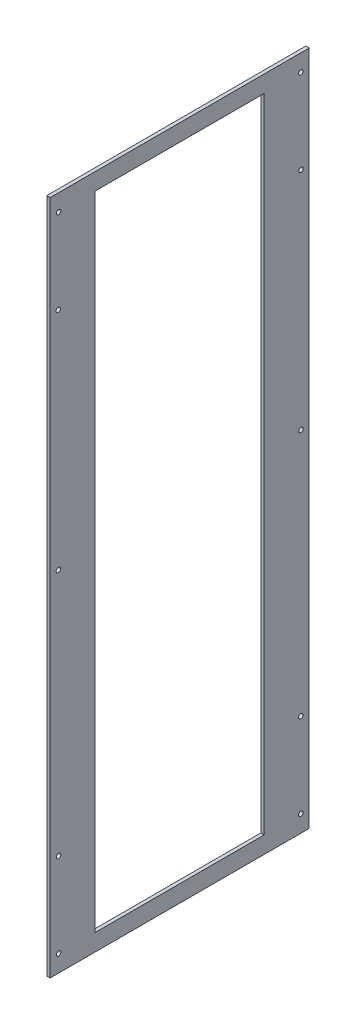
ISO-10303-21;
HEADER;
FILE_DESCRIPTION(('STEP AP214'),'2;1');
FILE_NAME('part.step','',(''),(''),'','','');
FILE_SCHEMA(('AUTOMOTIVE_DESIGN { 1 0 10303 214 1 1 1 1 }'));
ENDSEC;
DATA;
#1=APPLICATION_CONTEXT('core data for automotive mechanical design processes');
#2=APPLICATION_PROTOCOL_DEFINITION('international standard','automotive_design',2000,#1);
#3=PRODUCT_CONTEXT('',#1,'mechanical');
#4=PRODUCT('Part','Part','',(#3));
#5=PRODUCT_RELATED_PRODUCT_CATEGORY('part','',(#4));
#6=PRODUCT_DEFINITION_FORMATION('','',#4);
#7=PRODUCT_DEFINITION_CONTEXT('part definition',#1,'design');
#8=PRODUCT_DEFINITION('design','',#6,#7);
#9=PRODUCT_DEFINITION_SHAPE('','',#8);
#10=(LENGTH_UNIT() NAMED_UNIT(*) SI_UNIT(.MILLI.,.METRE.));
#11=(NAMED_UNIT(*) PLANE_ANGLE_UNIT() SI_UNIT($,.RADIAN.));
#12=(NAMED_UNIT(*) SI_UNIT($,.STERADIAN.) SOLID_ANGLE_UNIT());
#13=UNCERTAINTY_MEASURE_WITH_UNIT(LENGTH_MEASURE(1.E-05),#10,'distance_accuracy_value','');
#14=(GEOMETRIC_REPRESENTATION_CONTEXT(3) GLOBAL_UNCERTAINTY_ASSIGNED_CONTEXT((#13)) GLOBAL_UNIT_ASSIGNED_CONTEXT((#10,
#11,#12)) REPRESENTATION_CONTEXT('',''));
#15=CARTESIAN_POINT('',(0.,0.,0.));
#16=DIRECTION('',(0.,0.,1.));
#17=DIRECTION('',(1.,0.,0.));
#18=AXIS2_PLACEMENT_3D('',#15,#16,#17);
#19=CARTESIAN_POINT('',(3.,0.,0.));
#20=DIRECTION('',(-1.,0.,0.));
#21=DIRECTION('',(0.,0.,1.));
#22=AXIS2_PLACEMENT_3D('',#19,#20,#21);
#23=PLANE('',#22);
#24=DIRECTION('',(0.,1.,0.));
#25=VECTOR('',#24,1.);
#26=CARTESIAN_POINT('',(3.,-300.,-115.));
#27=LINE('',#26,#25);
#28=CARTESIAN_POINT('',(3.,-300.,-115.));
#29=VERTEX_POINT('',#28);
#30=CARTESIAN_POINT('',(3.,300.,-115.));
#31=VERTEX_POINT('',#30);
#32=EDGE_CURVE('E141',#29,#31,#27,.T.);
#33=ORIENTED_EDGE('',*,*,#32,.T.);
#34=DIRECTION('',(0.,0.,1.));
#35=VECTOR('',#34,1.);
#36=CARTESIAN_POINT('',(3.,300.,115.));
#37=LINE('',#36,#35);
#38=CARTESIAN_POINT('',(3.,300.,115.));
#39=VERTEX_POINT('',#38);
#40=EDGE_CURVE('E144',#31,#39,#37,.T.);
#41=ORIENTED_EDGE('',*,*,#40,.T.);
#42=DIRECTION('',(0.,-1.,0.));
#43=VECTOR('',#42,1.);
#44=CARTESIAN_POINT('',(3.,-300.,115.));
#45=LINE('',#44,#43);
#46=CARTESIAN_POINT('',(3.,-300.,115.));
#47=VERTEX_POINT('',#46);
#48=EDGE_CURVE('E147',#39,#47,#45,.T.);
#49=ORIENTED_EDGE('',*,*,#48,.T.);
#50=DIRECTION('',(0.,0.,-1.));
#51=VECTOR('',#50,1.);
#52=CARTESIAN_POINT('',(3.,-300.,115.));
#53=LINE('',#52,#51);
#54=EDGE_CURVE('E149',#47,#29,#53,.T.);
#55=ORIENTED_EDGE('',*,*,#54,.T.);
#56=EDGE_LOOP('',(#33,#41,#49,#55));
#57=FACE_BOUND('',#56,.T.);
#58=DIRECTION('',(0.,1.,0.));
#59=VECTOR('',#58,1.);
#60=CARTESIAN_POINT('',(3.,-285.,-75.));
#61=LINE('',#60,#59);
#62=CARTESIAN_POINT('',(3.,-285.,-75.));
#63=VERTEX_POINT('',#62);
#64=CARTESIAN_POINT('',(3.,285.,-75.));
#65=VERTEX_POINT('',#64);
#66=EDGE_CURVE('E102',#63,#65,#61,.T.);
#67=ORIENTED_EDGE('',*,*,#66,.F.);
#68=DIRECTION('',(0.,0.,-1.));
#69=VECTOR('',#68,1.);
#70=CARTESIAN_POINT('',(3.,-285.,75.));
#71=LINE('',#70,#69);
#72=CARTESIAN_POINT('',(3.,-285.,75.));
#73=VERTEX_POINT('',#72);
#74=EDGE_CURVE('E125',#73,#63,#71,.T.);
#75=ORIENTED_EDGE('',*,*,#74,.F.);
#76=DIRECTION('',(0.,-1.,0.));
#77=VECTOR('',#76,1.);
#78=CARTESIAN_POINT('',(3.,-285.,75.));
#79=LINE('',#78,#77);
#80=CARTESIAN_POINT('',(3.,285.,75.));
#81=VERTEX_POINT('',#80);
#82=EDGE_CURVE('E123',#81,#73,#79,.T.);
#83=ORIENTED_EDGE('',*,*,#82,.F.);
#84=DIRECTION('',(0.,0.,1.));
#85=VECTOR('',#84,1.);
#86=CARTESIAN_POINT('',(3.,285.,75.));
#87=LINE('',#86,#85);
#88=EDGE_CURVE('E110',#65,#81,#87,.T.);
#89=ORIENTED_EDGE('',*,*,#88,.F.);
#90=EDGE_LOOP('',(#67,#75,#83,#89));
#91=FACE_BOUND('',#90,.T.);
#92=CARTESIAN_POINT('',(3.,285.,107.5));
#93=DIRECTION('',(1.,0.,0.));
#94=DIRECTION('',(0.,0.,-1.));
#95=AXIS2_PLACEMENT_3D('',#92,#93,#94);
#96=CIRCLE('',#95,2.);
#97=CARTESIAN_POINT('',(3.,285.,105.5));
#98=VERTEX_POINT('',#97);
#99=EDGE_CURVE('E131',#98,#98,#96,.T.);
#100=ORIENTED_EDGE('',*,*,#99,.F.);
#101=EDGE_LOOP('',(#100));
#102=FACE_BOUND('',#101,.T.);
#103=CARTESIAN_POINT('',(3.,210.,107.698004771645));
#104=DIRECTION('',(1.,0.,0.));
#105=DIRECTION('',(0.,0.,-1.));
#106=AXIS2_PLACEMENT_3D('',#103,#104,#105);
#107=CIRCLE('',#106,2.);
#108=CARTESIAN_POINT('',(3.,210.,105.698004771645));
#109=VERTEX_POINT('',#108);
#110=EDGE_CURVE('E313',#109,#109,#107,.T.);
#111=ORIENTED_EDGE('',*,*,#110,.F.);
#112=EDGE_LOOP('',(#111));
#113=FACE_BOUND('',#112,.T.);
#114=CARTESIAN_POINT('',(3.,-210.,107.5));
#115=DIRECTION('',(1.,0.,0.));
#116=DIRECTION('',(0.,0.,-1.));
#117=AXIS2_PLACEMENT_3D('',#114,#115,#116);
#118=CIRCLE('',#117,2.);
#119=CARTESIAN_POINT('',(3.,-210.,105.5));
#120=VERTEX_POINT('',#119);
#121=EDGE_CURVE('E307',#120,#120,#118,.T.);
#122=ORIENTED_EDGE('',*,*,#121,.F.);
#123=EDGE_LOOP('',(#122));
#124=FACE_BOUND('',#123,.T.);
#125=CARTESIAN_POINT('',(3.,-285.,107.5));
#126=DIRECTION('',(1.,0.,0.));
#127=DIRECTION('',(0.,0.,-1.));
#128=AXIS2_PLACEMENT_3D('',#125,#126,#127);
#129=CIRCLE('',#128,2.);
#130=CARTESIAN_POINT('',(3.,-285.,105.5));
#131=VERTEX_POINT('',#130);
#132=EDGE_CURVE('E301',#131,#131,#129,.T.);
#133=ORIENTED_EDGE('',*,*,#132,.F.);
#134=EDGE_LOOP('',(#133));
#135=FACE_BOUND('',#134,.T.);
#136=CARTESIAN_POINT('',(3.,10.,107.698004771645));
#137=DIRECTION('',(1.,0.,0.));
#138=DIRECTION('',(0.,0.,-1.));
#139=AXIS2_PLACEMENT_3D('',#136,#137,#138);
#140=CIRCLE('',#139,2.);
#141=CARTESIAN_POINT('',(3.,10.,105.698004771645));
#142=VERTEX_POINT('',#141);
#143=EDGE_CURVE('E295',#142,#142,#140,.T.);
#144=ORIENTED_EDGE('',*,*,#143,.F.);
#145=EDGE_LOOP('',(#144));
#146=FACE_BOUND('',#145,.T.);
#147=CARTESIAN_POINT('',(3.,-285.,-107.5));
#148=DIRECTION('',(1.,0.,0.));
#149=DIRECTION('',(0.,0.,1.));
#150=AXIS2_PLACEMENT_3D('',#147,#148,#149);
#151=CIRCLE('',#150,2.);
#152=CARTESIAN_POINT('',(3.,-285.,-105.5));
#153=VERTEX_POINT('',#152);
#154=EDGE_CURVE('E289',#153,#153,#151,.T.);
#155=ORIENTED_EDGE('',*,*,#154,.F.);
#156=EDGE_LOOP('',(#155));
#157=FACE_BOUND('',#156,.T.);
#158=CARTESIAN_POINT('',(3.,-210.,-107.5));
#159=DIRECTION('',(1.,0.,0.));
#160=DIRECTION('',(0.,0.,1.));
#161=AXIS2_PLACEMENT_3D('',#158,#159,#160);
#162=CIRCLE('',#161,2.);
#163=CARTESIAN_POINT('',(3.,-210.,-105.5));
#164=VERTEX_POINT('',#163);
#165=EDGE_CURVE('E283',#164,#164,#162,.T.);
#166=ORIENTED_EDGE('',*,*,#165,.F.);
#167=EDGE_LOOP('',(#166));
#168=FACE_BOUND('',#167,.T.);
#169=CARTESIAN_POINT('',(3.,210.,-107.698004771645));
#170=DIRECTION('',(1.,0.,0.));
#171=DIRECTION('',(0.,0.,1.));
#172=AXIS2_PLACEMENT_3D('',#169,#170,#171);
#173=CIRCLE('',#172,2.);
#174=CARTESIAN_POINT('',(3.,210.,-105.698004771645));
#175=VERTEX_POINT('',#174);
#176=EDGE_CURVE('E277',#175,#175,#173,.T.);
#177=ORIENTED_EDGE('',*,*,#176,.F.);
#178=EDGE_LOOP('',(#177));
#179=FACE_BOUND('',#178,.T.);
#180=CARTESIAN_POINT('',(3.,285.,-107.5));
#181=DIRECTION('',(1.,0.,0.));
#182=DIRECTION('',(0.,0.,1.));
#183=AXIS2_PLACEMENT_3D('',#180,#181,#182);
#184=CIRCLE('',#183,2.);
#185=CARTESIAN_POINT('',(3.,285.,-105.5));
#186=VERTEX_POINT('',#185);
#187=EDGE_CURVE('E271',#186,#186,#184,.T.);
#188=ORIENTED_EDGE('',*,*,#187,.F.);
#189=EDGE_LOOP('',(#188));
#190=FACE_BOUND('',#189,.T.);
#191=CARTESIAN_POINT('',(3.,10.,-107.698004771645));
#192=DIRECTION('',(1.,0.,0.));
#193=DIRECTION('',(0.,0.,1.));
#194=AXIS2_PLACEMENT_3D('',#191,#192,#193);
#195=CIRCLE('',#194,2.);
#196=CARTESIAN_POINT('',(3.,10.,-105.698004771645));
#197=VERTEX_POINT('',#196);
#198=EDGE_CURVE('E262',#197,#197,#195,.T.);
#199=ORIENTED_EDGE('',*,*,#198,.F.);
#200=EDGE_LOOP('',(#199));
#201=FACE_BOUND('',#200,.T.);
#202=ADVANCED_FACE('F37',(#57,#91,#102,#113,#124,#135,#146,#157,#168,#179,#190,#201),#23,.F.);
#203=CARTESIAN_POINT('',(0.,0.,0.));
#204=DIRECTION('',(-1.,0.,0.));
#205=DIRECTION('',(0.,0.,1.));
#206=AXIS2_PLACEMENT_3D('',#203,#204,#205);
#207=PLANE('',#206);
#208=CARTESIAN_POINT('',(0.,285.,-107.5));
#209=DIRECTION('',(1.,0.,0.));
#210=DIRECTION('',(0.,0.,1.));
#211=AXIS2_PLACEMENT_3D('',#208,#209,#210);
#212=CIRCLE('',#211,2.);
#213=CARTESIAN_POINT('',(0.,285.,-105.5));
#214=VERTEX_POINT('',#213);
#215=EDGE_CURVE('E268',#214,#214,#212,.T.);
#216=ORIENTED_EDGE('',*,*,#215,.T.);
#217=EDGE_LOOP('',(#216));
#218=FACE_BOUND('',#217,.T.);
#219=CARTESIAN_POINT('',(0.,-210.,-107.5));
#220=DIRECTION('',(1.,0.,0.));
#221=DIRECTION('',(0.,0.,1.));
#222=AXIS2_PLACEMENT_3D('',#219,#220,#221);
#223=CIRCLE('',#222,2.);
#224=CARTESIAN_POINT('',(0.,-210.,-105.5));
#225=VERTEX_POINT('',#224);
#226=EDGE_CURVE('E280',#225,#225,#223,.T.);
#227=ORIENTED_EDGE('',*,*,#226,.T.);
#228=EDGE_LOOP('',(#227));
#229=FACE_BOUND('',#228,.T.);
#230=CARTESIAN_POINT('',(0.,10.,107.698004771645));
#231=DIRECTION('',(1.,0.,0.));
#232=DIRECTION('',(0.,0.,-1.));
#233=AXIS2_PLACEMENT_3D('',#230,#231,#232);
#234=CIRCLE('',#233,2.);
#235=CARTESIAN_POINT('',(0.,10.,105.698004771645));
#236=VERTEX_POINT('',#235);
#237=EDGE_CURVE('E292',#236,#236,#234,.T.);
#238=ORIENTED_EDGE('',*,*,#237,.T.);
#239=EDGE_LOOP('',(#238));
#240=FACE_BOUND('',#239,.T.);
#241=CARTESIAN_POINT('',(0.,-210.,107.5));
#242=DIRECTION('',(1.,0.,0.));
#243=DIRECTION('',(0.,0.,-1.));
#244=AXIS2_PLACEMENT_3D('',#241,#242,#243);
#245=CIRCLE('',#244,2.);
#246=CARTESIAN_POINT('',(0.,-210.,105.5));
#247=VERTEX_POINT('',#246);
#248=EDGE_CURVE('E304',#247,#247,#245,.T.);
#249=ORIENTED_EDGE('',*,*,#248,.T.);
#250=EDGE_LOOP('',(#249));
#251=FACE_BOUND('',#250,.T.);
#252=CARTESIAN_POINT('',(0.,285.,107.5));
#253=DIRECTION('',(1.,0.,0.));
#254=DIRECTION('',(0.,0.,-1.));
#255=AXIS2_PLACEMENT_3D('',#252,#253,#254);
#256=CIRCLE('',#255,2.);
#257=CARTESIAN_POINT('',(0.,285.,105.5));
#258=VERTEX_POINT('',#257);
#259=EDGE_CURVE('E316',#258,#258,#256,.T.);
#260=ORIENTED_EDGE('',*,*,#259,.T.);
#261=EDGE_LOOP('',(#260));
#262=FACE_BOUND('',#261,.T.);
#263=DIRECTION('',(0.,1.,0.));
#264=VECTOR('',#263,1.);
#265=CARTESIAN_POINT('',(0.,-300.,-115.));
#266=LINE('',#265,#264);
#267=CARTESIAN_POINT('',(0.,-300.,-115.));
#268=VERTEX_POINT('',#267);
#269=CARTESIAN_POINT('',(0.,300.,-115.));
#270=VERTEX_POINT('',#269);
#271=EDGE_CURVE('E118',#268,#270,#266,.T.);
#272=ORIENTED_EDGE('',*,*,#271,.F.);
#273=DIRECTION('',(0.,0.,-1.));
#274=VECTOR('',#273,1.);
#275=CARTESIAN_POINT('',(0.,-300.,115.));
#276=LINE('',#275,#274);
#277=CARTESIAN_POINT('',(0.,-300.,115.));
#278=VERTEX_POINT('',#277);
#279=EDGE_CURVE('E145',#278,#268,#276,.T.);
#280=ORIENTED_EDGE('',*,*,#279,.F.);
#281=DIRECTION('',(0.,-1.,0.));
#282=VECTOR('',#281,1.);
#283=CARTESIAN_POINT('',(0.,-300.,115.));
#284=LINE('',#283,#282);
#285=CARTESIAN_POINT('',(0.,300.,115.));
#286=VERTEX_POINT('',#285);
#287=EDGE_CURVE('E156',#286,#278,#284,.T.);
#288=ORIENTED_EDGE('',*,*,#287,.F.);
#289=DIRECTION('',(0.,0.,1.));
#290=VECTOR('',#289,1.);
#291=CARTESIAN_POINT('',(0.,300.,115.));
#292=LINE('',#291,#290);
#293=EDGE_CURVE('E154',#270,#286,#292,.T.);
#294=ORIENTED_EDGE('',*,*,#293,.F.);
#295=EDGE_LOOP('',(#272,#280,#288,#294));
#296=FACE_BOUND('',#295,.T.);
#297=DIRECTION('',(0.,0.,-1.));
#298=VECTOR('',#297,1.);
#299=CARTESIAN_POINT('',(0.,-285.,75.));
#300=LINE('',#299,#298);
#301=CARTESIAN_POINT('',(0.,-285.,75.));
#302=VERTEX_POINT('',#301);
#303=CARTESIAN_POINT('',(0.,-285.,-75.));
#304=VERTEX_POINT('',#303);
#305=EDGE_CURVE('E111',#302,#304,#300,.T.);
#306=ORIENTED_EDGE('',*,*,#305,.T.);
#307=DIRECTION('',(0.,1.,0.));
#308=VECTOR('',#307,1.);
#309=CARTESIAN_POINT('',(0.,-285.,-75.));
#310=LINE('',#309,#308);
#311=CARTESIAN_POINT('',(0.,285.,-75.));
#312=VERTEX_POINT('',#311);
#313=EDGE_CURVE('E60',#304,#312,#310,.T.);
#314=ORIENTED_EDGE('',*,*,#313,.T.);
#315=DIRECTION('',(0.,0.,1.));
#316=VECTOR('',#315,1.);
#317=CARTESIAN_POINT('',(0.,285.,75.));
#318=LINE('',#317,#316);
#319=CARTESIAN_POINT('',(0.,285.,75.));
#320=VERTEX_POINT('',#319);
#321=EDGE_CURVE('E117',#312,#320,#318,.T.);
#322=ORIENTED_EDGE('',*,*,#321,.T.);
#323=DIRECTION('',(0.,-1.,0.));
#324=VECTOR('',#323,1.);
#325=CARTESIAN_POINT('',(0.,-285.,75.));
#326=LINE('',#325,#324);
#327=EDGE_CURVE('E133',#320,#302,#326,.T.);
#328=ORIENTED_EDGE('',*,*,#327,.T.);
#329=EDGE_LOOP('',(#306,#314,#322,#328));
#330=FACE_BOUND('',#329,.T.);
#331=CARTESIAN_POINT('',(0.,210.,107.698004771645));
#332=DIRECTION('',(1.,0.,0.));
#333=DIRECTION('',(0.,0.,-1.));
#334=AXIS2_PLACEMENT_3D('',#331,#332,#333);
#335=CIRCLE('',#334,2.);
#336=CARTESIAN_POINT('',(0.,210.,105.698004771645));
#337=VERTEX_POINT('',#336);
#338=EDGE_CURVE('E310',#337,#337,#335,.T.);
#339=ORIENTED_EDGE('',*,*,#338,.T.);
#340=EDGE_LOOP('',(#339));
#341=FACE_BOUND('',#340,.T.);
#342=CARTESIAN_POINT('',(0.,-285.,107.5));
#343=DIRECTION('',(1.,0.,0.));
#344=DIRECTION('',(0.,0.,-1.));
#345=AXIS2_PLACEMENT_3D('',#342,#343,#344);
#346=CIRCLE('',#345,2.);
#347=CARTESIAN_POINT('',(0.,-285.,105.5));
#348=VERTEX_POINT('',#347);
#349=EDGE_CURVE('E298',#348,#348,#346,.T.);
#350=ORIENTED_EDGE('',*,*,#349,.T.);
#351=EDGE_LOOP('',(#350));
#352=FACE_BOUND('',#351,.T.);
#353=CARTESIAN_POINT('',(0.,-285.,-107.5));
#354=DIRECTION('',(1.,0.,0.));
#355=DIRECTION('',(0.,0.,1.));
#356=AXIS2_PLACEMENT_3D('',#353,#354,#355);
#357=CIRCLE('',#356,2.);
#358=CARTESIAN_POINT('',(0.,-285.,-105.5));
#359=VERTEX_POINT('',#358);
#360=EDGE_CURVE('E286',#359,#359,#357,.T.);
#361=ORIENTED_EDGE('',*,*,#360,.T.);
#362=EDGE_LOOP('',(#361));
#363=FACE_BOUND('',#362,.T.);
#364=CARTESIAN_POINT('',(0.,210.,-107.698004771645));
#365=DIRECTION('',(1.,0.,0.));
#366=DIRECTION('',(0.,0.,1.));
#367=AXIS2_PLACEMENT_3D('',#364,#365,#366);
#368=CIRCLE('',#367,2.);
#369=CARTESIAN_POINT('',(0.,210.,-105.698004771645));
#370=VERTEX_POINT('',#369);
#371=EDGE_CURVE('E274',#370,#370,#368,.T.);
#372=ORIENTED_EDGE('',*,*,#371,.T.);
#373=EDGE_LOOP('',(#372));
#374=FACE_BOUND('',#373,.T.);
#375=CARTESIAN_POINT('',(0.,10.,-107.698004771645));
#376=DIRECTION('',(1.,0.,0.));
#377=DIRECTION('',(0.,0.,1.));
#378=AXIS2_PLACEMENT_3D('',#375,#376,#377);
#379=CIRCLE('',#378,2.);
#380=CARTESIAN_POINT('',(0.,10.,-105.698004771645));
#381=VERTEX_POINT('',#380);
#382=EDGE_CURVE('E265',#381,#381,#379,.T.);
#383=ORIENTED_EDGE('',*,*,#382,.T.);
#384=EDGE_LOOP('',(#383));
#385=FACE_BOUND('',#384,.T.);
#386=ADVANCED_FACE('F174',(#218,#229,#240,#251,#262,#296,#330,#341,#352,#363,#374,#385),#207,.T.);
#387=CARTESIAN_POINT('',(3.,-300.,-115.));
#388=DIRECTION('',(0.,0.,1.));
#389=DIRECTION('',(1.,0.,0.));
#390=AXIS2_PLACEMENT_3D('',#387,#388,#389);
#391=PLANE('',#390);
#392=ORIENTED_EDGE('',*,*,#271,.T.);
#393=DIRECTION('',(-1.,0.,0.));
#394=VECTOR('',#393,1.);
#395=CARTESIAN_POINT('',(3.,300.,-115.));
#396=LINE('',#395,#394);
#397=EDGE_CURVE('E11',#31,#270,#396,.T.);
#398=ORIENTED_EDGE('',*,*,#397,.F.);
#399=ORIENTED_EDGE('',*,*,#32,.F.);
#400=DIRECTION('',(-1.,0.,0.));
#401=VECTOR('',#400,1.);
#402=CARTESIAN_POINT('',(3.,-300.,-115.));
#403=LINE('',#402,#401);
#404=EDGE_CURVE('E151',#29,#268,#403,.T.);
#405=ORIENTED_EDGE('',*,*,#404,.T.);
#406=EDGE_LOOP('',(#392,#398,#399,#405));
#407=FACE_BOUND('',#406,.T.);
#408=ADVANCED_FACE('F39',(#407),#391,.F.);
#409=CARTESIAN_POINT('',(3.,300.,115.));
#410=DIRECTION('',(0.,-1.,0.));
#411=DIRECTION('',(0.,0.,-1.));
#412=AXIS2_PLACEMENT_3D('',#409,#410,#411);
#413=PLANE('',#412);
#414=ORIENTED_EDGE('',*,*,#293,.T.);
#415=DIRECTION('',(-1.,0.,0.));
#416=VECTOR('',#415,1.);
#417=CARTESIAN_POINT('',(3.,300.,115.));
#418=LINE('',#417,#416);
#419=EDGE_CURVE('E45',#39,#286,#418,.T.);
#420=ORIENTED_EDGE('',*,*,#419,.F.);
#421=ORIENTED_EDGE('',*,*,#40,.F.);
#422=ORIENTED_EDGE('',*,*,#397,.T.);
#423=EDGE_LOOP('',(#414,#420,#421,#422));
#424=FACE_BOUND('',#423,.T.);
#425=ADVANCED_FACE('F184',(#424),#413,.F.);
#426=CARTESIAN_POINT('',(3.,-300.,115.));
#427=DIRECTION('',(0.,0.,-1.));
#428=DIRECTION('',(-1.,0.,0.));
#429=AXIS2_PLACEMENT_3D('',#426,#427,#428);
#430=PLANE('',#429);
#431=ORIENTED_EDGE('',*,*,#287,.T.);
#432=DIRECTION('',(-1.,0.,0.));
#433=VECTOR('',#432,1.);
#434=CARTESIAN_POINT('',(3.,-300.,115.));
#435=LINE('',#434,#433);
#436=EDGE_CURVE('E161',#47,#278,#435,.T.);
#437=ORIENTED_EDGE('',*,*,#436,.F.);
#438=ORIENTED_EDGE('',*,*,#48,.F.);
#439=ORIENTED_EDGE('',*,*,#419,.T.);
#440=EDGE_LOOP('',(#431,#437,#438,#439));
#441=FACE_BOUND('',#440,.T.);
#442=ADVANCED_FACE('F168',(#441),#430,.F.);
#443=CARTESIAN_POINT('',(3.,-300.,115.));
#444=DIRECTION('',(0.,1.,0.));
#445=DIRECTION('',(0.,0.,1.));
#446=AXIS2_PLACEMENT_3D('',#443,#444,#445);
#447=PLANE('',#446);
#448=ORIENTED_EDGE('',*,*,#279,.T.);
#449=ORIENTED_EDGE('',*,*,#404,.F.);
#450=ORIENTED_EDGE('',*,*,#54,.F.);
#451=ORIENTED_EDGE('',*,*,#436,.T.);
#452=EDGE_LOOP('',(#448,#449,#450,#451));
#453=FACE_BOUND('',#452,.T.);
#454=ADVANCED_FACE('F178',(#453),#447,.F.);
#455=CARTESIAN_POINT('',(3.,-285.,-75.));
#456=DIRECTION('',(0.,0.,1.));
#457=DIRECTION('',(1.,0.,0.));
#458=AXIS2_PLACEMENT_3D('',#455,#456,#457);
#459=PLANE('',#458);
#460=ORIENTED_EDGE('',*,*,#313,.F.);
#461=DIRECTION('',(-1.,0.,0.));
#462=VECTOR('',#461,1.);
#463=CARTESIAN_POINT('',(3.,-285.,-75.));
#464=LINE('',#463,#462);
#465=EDGE_CURVE('E106',#63,#304,#464,.T.);
#466=ORIENTED_EDGE('',*,*,#465,.F.);
#467=ORIENTED_EDGE('',*,*,#66,.T.);
#468=DIRECTION('',(-1.,0.,0.));
#469=VECTOR('',#468,1.);
#470=CARTESIAN_POINT('',(3.,285.,-75.));
#471=LINE('',#470,#469);
#472=EDGE_CURVE('E105',#65,#312,#471,.T.);
#473=ORIENTED_EDGE('',*,*,#472,.T.);
#474=EDGE_LOOP('',(#460,#466,#467,#473));
#475=FACE_BOUND('',#474,.T.);
#476=ADVANCED_FACE('F104',(#475),#459,.T.);
#477=CARTESIAN_POINT('',(3.,285.,75.));
#478=DIRECTION('',(0.,-1.,0.));
#479=DIRECTION('',(0.,0.,-1.));
#480=AXIS2_PLACEMENT_3D('',#477,#478,#479);
#481=PLANE('',#480);
#482=ORIENTED_EDGE('',*,*,#321,.F.);
#483=ORIENTED_EDGE('',*,*,#472,.F.);
#484=ORIENTED_EDGE('',*,*,#88,.T.);
#485=DIRECTION('',(-1.,0.,0.));
#486=VECTOR('',#485,1.);
#487=CARTESIAN_POINT('',(3.,285.,75.));
#488=LINE('',#487,#486);
#489=EDGE_CURVE('E119',#81,#320,#488,.T.);
#490=ORIENTED_EDGE('',*,*,#489,.T.);
#491=EDGE_LOOP('',(#482,#483,#484,#490));
#492=FACE_BOUND('',#491,.T.);
#493=ADVANCED_FACE('F114',(#492),#481,.T.);
#494=CARTESIAN_POINT('',(3.,-285.,75.));
#495=DIRECTION('',(0.,0.,-1.));
#496=DIRECTION('',(-1.,0.,0.));
#497=AXIS2_PLACEMENT_3D('',#494,#495,#496);
#498=PLANE('',#497);
#499=ORIENTED_EDGE('',*,*,#327,.F.);
#500=ORIENTED_EDGE('',*,*,#489,.F.);
#501=ORIENTED_EDGE('',*,*,#82,.T.);
#502=DIRECTION('',(-1.,0.,0.));
#503=VECTOR('',#502,1.);
#504=CARTESIAN_POINT('',(3.,-285.,75.));
#505=LINE('',#504,#503);
#506=EDGE_CURVE('E52',#73,#302,#505,.T.);
#507=ORIENTED_EDGE('',*,*,#506,.T.);
#508=EDGE_LOOP('',(#499,#500,#501,#507));
#509=FACE_BOUND('',#508,.T.);
#510=ADVANCED_FACE('F208',(#509),#498,.T.);
#511=CARTESIAN_POINT('',(3.,-285.,75.));
#512=DIRECTION('',(0.,1.,0.));
#513=DIRECTION('',(0.,0.,1.));
#514=AXIS2_PLACEMENT_3D('',#511,#512,#513);
#515=PLANE('',#514);
#516=ORIENTED_EDGE('',*,*,#305,.F.);
#517=ORIENTED_EDGE('',*,*,#506,.F.);
#518=ORIENTED_EDGE('',*,*,#74,.T.);
#519=ORIENTED_EDGE('',*,*,#465,.T.);
#520=EDGE_LOOP('',(#516,#517,#518,#519));
#521=FACE_BOUND('',#520,.T.);
#522=ADVANCED_FACE('F212',(#521),#515,.T.);
#523=CARTESIAN_POINT('',(3.,285.,107.5));
#524=DIRECTION('',(-1.,0.,0.));
#525=DIRECTION('',(0.,0.,1.));
#526=AXIS2_PLACEMENT_3D('',#523,#524,#525);
#527=CYLINDRICAL_SURFACE('',#526,2.);
#528=ORIENTED_EDGE('',*,*,#99,.T.);
#529=EDGE_LOOP('',(#528));
#530=FACE_BOUND('',#529,.T.);
#531=ORIENTED_EDGE('',*,*,#259,.F.);
#532=EDGE_LOOP('',(#531));
#533=FACE_BOUND('',#532,.T.);
#534=ADVANCED_FACE('F218',(#530,#533),#527,.F.);
#535=CARTESIAN_POINT('',(3.,210.,107.698004771645));
#536=DIRECTION('',(-1.,0.,0.));
#537=DIRECTION('',(0.,0.,1.));
#538=AXIS2_PLACEMENT_3D('',#535,#536,#537);
#539=CYLINDRICAL_SURFACE('',#538,2.);
#540=ORIENTED_EDGE('',*,*,#110,.T.);
#541=EDGE_LOOP('',(#540));
#542=FACE_BOUND('',#541,.T.);
#543=ORIENTED_EDGE('',*,*,#338,.F.);
#544=EDGE_LOOP('',(#543));
#545=FACE_BOUND('',#544,.T.);
#546=ADVANCED_FACE('F221',(#542,#545),#539,.F.);
#547=CARTESIAN_POINT('',(3.,-210.,107.5));
#548=DIRECTION('',(-1.,0.,0.));
#549=DIRECTION('',(0.,0.,1.));
#550=AXIS2_PLACEMENT_3D('',#547,#548,#549);
#551=CYLINDRICAL_SURFACE('',#550,2.);
#552=ORIENTED_EDGE('',*,*,#121,.T.);
#553=EDGE_LOOP('',(#552));
#554=FACE_BOUND('',#553,.T.);
#555=ORIENTED_EDGE('',*,*,#248,.F.);
#556=EDGE_LOOP('',(#555));
#557=FACE_BOUND('',#556,.T.);
#558=ADVANCED_FACE('F225',(#554,#557),#551,.F.);
#559=CARTESIAN_POINT('',(3.,-285.,107.5));
#560=DIRECTION('',(-1.,0.,0.));
#561=DIRECTION('',(0.,0.,1.));
#562=AXIS2_PLACEMENT_3D('',#559,#560,#561);
#563=CYLINDRICAL_SURFACE('',#562,2.);
#564=ORIENTED_EDGE('',*,*,#132,.T.);
#565=EDGE_LOOP('',(#564));
#566=FACE_BOUND('',#565,.T.);
#567=ORIENTED_EDGE('',*,*,#349,.F.);
#568=EDGE_LOOP('',(#567));
#569=FACE_BOUND('',#568,.T.);
#570=ADVANCED_FACE('F229',(#566,#569),#563,.F.);
#571=CARTESIAN_POINT('',(3.,10.,107.698004771645));
#572=DIRECTION('',(-1.,0.,0.));
#573=DIRECTION('',(0.,0.,1.));
#574=AXIS2_PLACEMENT_3D('',#571,#572,#573);
#575=CYLINDRICAL_SURFACE('',#574,2.);
#576=ORIENTED_EDGE('',*,*,#143,.T.);
#577=EDGE_LOOP('',(#576));
#578=FACE_BOUND('',#577,.T.);
#579=ORIENTED_EDGE('',*,*,#237,.F.);
#580=EDGE_LOOP('',(#579));
#581=FACE_BOUND('',#580,.T.);
#582=ADVANCED_FACE('F233',(#578,#581),#575,.F.);
#583=CARTESIAN_POINT('',(3.,-285.,-107.5));
#584=DIRECTION('',(-1.,0.,0.));
#585=DIRECTION('',(0.,0.,1.));
#586=AXIS2_PLACEMENT_3D('',#583,#584,#585);
#587=CYLINDRICAL_SURFACE('',#586,2.);
#588=ORIENTED_EDGE('',*,*,#154,.T.);
#589=EDGE_LOOP('',(#588));
#590=FACE_BOUND('',#589,.T.);
#591=ORIENTED_EDGE('',*,*,#360,.F.);
#592=EDGE_LOOP('',(#591));
#593=FACE_BOUND('',#592,.T.);
#594=ADVANCED_FACE('F237',(#590,#593),#587,.F.);
#595=CARTESIAN_POINT('',(3.,-210.,-107.5));
#596=DIRECTION('',(-1.,0.,0.));
#597=DIRECTION('',(0.,0.,1.));
#598=AXIS2_PLACEMENT_3D('',#595,#596,#597);
#599=CYLINDRICAL_SURFACE('',#598,2.);
#600=ORIENTED_EDGE('',*,*,#165,.T.);
#601=EDGE_LOOP('',(#600));
#602=FACE_BOUND('',#601,.T.);
#603=ORIENTED_EDGE('',*,*,#226,.F.);
#604=EDGE_LOOP('',(#603));
#605=FACE_BOUND('',#604,.T.);
#606=ADVANCED_FACE('F241',(#602,#605),#599,.F.);
#607=CARTESIAN_POINT('',(3.,210.,-107.698004771645));
#608=DIRECTION('',(-1.,0.,0.));
#609=DIRECTION('',(0.,0.,1.));
#610=AXIS2_PLACEMENT_3D('',#607,#608,#609);
#611=CYLINDRICAL_SURFACE('',#610,2.);
#612=ORIENTED_EDGE('',*,*,#176,.T.);
#613=EDGE_LOOP('',(#612));
#614=FACE_BOUND('',#613,.T.);
#615=ORIENTED_EDGE('',*,*,#371,.F.);
#616=EDGE_LOOP('',(#615));
#617=FACE_BOUND('',#616,.T.);
#618=ADVANCED_FACE('F245',(#614,#617),#611,.F.);
#619=CARTESIAN_POINT('',(3.,285.,-107.5));
#620=DIRECTION('',(-1.,0.,0.));
#621=DIRECTION('',(0.,0.,1.));
#622=AXIS2_PLACEMENT_3D('',#619,#620,#621);
#623=CYLINDRICAL_SURFACE('',#622,2.);
#624=ORIENTED_EDGE('',*,*,#187,.T.);
#625=EDGE_LOOP('',(#624));
#626=FACE_BOUND('',#625,.T.);
#627=ORIENTED_EDGE('',*,*,#215,.F.);
#628=EDGE_LOOP('',(#627));
#629=FACE_BOUND('',#628,.T.);
#630=ADVANCED_FACE('F249',(#626,#629),#623,.F.);
#631=CARTESIAN_POINT('',(3.,10.,-107.698004771645));
#632=DIRECTION('',(-1.,0.,0.));
#633=DIRECTION('',(0.,0.,1.));
#634=AXIS2_PLACEMENT_3D('',#631,#632,#633);
#635=CYLINDRICAL_SURFACE('',#634,2.);
#636=ORIENTED_EDGE('',*,*,#198,.T.);
#637=EDGE_LOOP('',(#636));
#638=FACE_BOUND('',#637,.T.);
#639=ORIENTED_EDGE('',*,*,#382,.F.);
#640=EDGE_LOOP('',(#639));
#641=FACE_BOUND('',#640,.T.);
#642=ADVANCED_FACE('F253',(#638,#641),#635,.F.);
#643=CLOSED_SHELL('',(#202,#386,#408,#425,#442,#454,#476,#493,#510,#522,#534,#546,#558,#570,
#582,#594,#606,#618,#630,#642));
#644=MANIFOLD_SOLID_BREP('B2',#643);
#645=ADVANCED_BREP_SHAPE_REPRESENTATION('',(#18,#644),#14);
#646=SHAPE_DEFINITION_REPRESENTATION(#9,#645);
ENDSEC;
END-ISO-10303-21;
